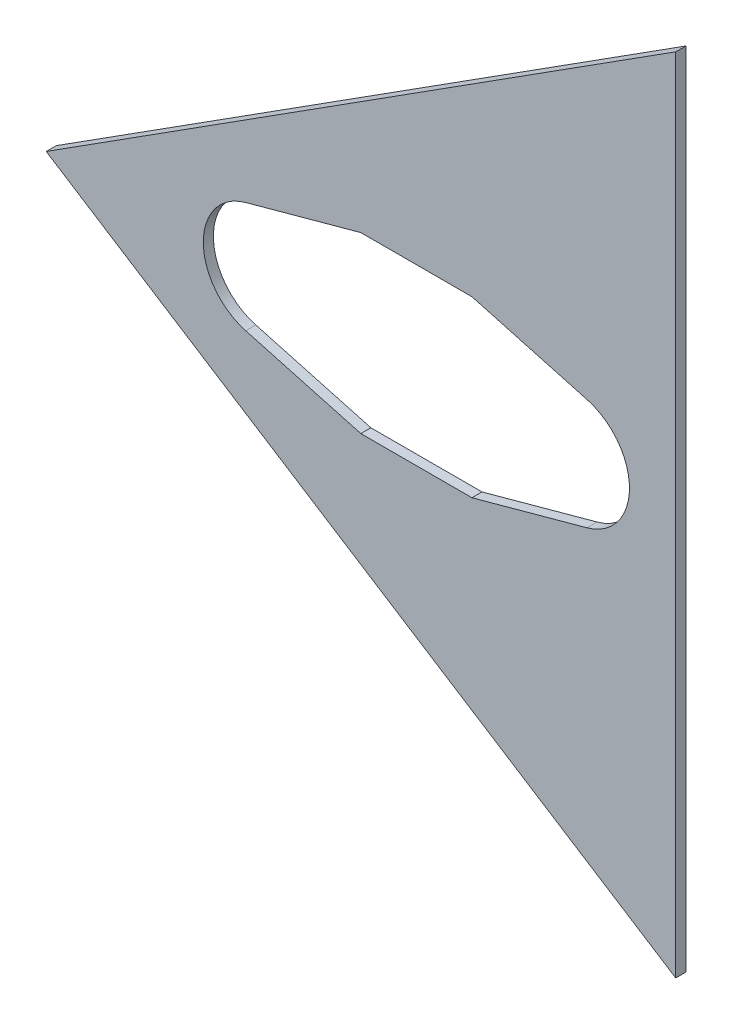
ISO-10303-21;
HEADER;
FILE_DESCRIPTION(('STEP AP214'),'2;1');
FILE_NAME('part.step','',(''),(''),'','','');
FILE_SCHEMA(('AUTOMOTIVE_DESIGN { 1 0 10303 214 1 1 1 1 }'));
ENDSEC;
DATA;
#1=APPLICATION_CONTEXT('core data for automotive mechanical design processes');
#2=APPLICATION_PROTOCOL_DEFINITION('international standard','automotive_design',2000,#1);
#3=PRODUCT_CONTEXT('',#1,'mechanical');
#4=PRODUCT('Part','Part','',(#3));
#5=PRODUCT_RELATED_PRODUCT_CATEGORY('part','',(#4));
#6=PRODUCT_DEFINITION_FORMATION('','',#4);
#7=PRODUCT_DEFINITION_CONTEXT('part definition',#1,'design');
#8=PRODUCT_DEFINITION('design','',#6,#7);
#9=PRODUCT_DEFINITION_SHAPE('','',#8);
#10=(LENGTH_UNIT() NAMED_UNIT(*) SI_UNIT(.MILLI.,.METRE.));
#11=(NAMED_UNIT(*) PLANE_ANGLE_UNIT() SI_UNIT($,.RADIAN.));
#12=(NAMED_UNIT(*) SI_UNIT($,.STERADIAN.) SOLID_ANGLE_UNIT());
#13=UNCERTAINTY_MEASURE_WITH_UNIT(LENGTH_MEASURE(1.E-05),#10,'distance_accuracy_value','');
#14=(GEOMETRIC_REPRESENTATION_CONTEXT(3) GLOBAL_UNCERTAINTY_ASSIGNED_CONTEXT((#13)) GLOBAL_UNIT_ASSIGNED_CONTEXT((#10,
#11,#12)) REPRESENTATION_CONTEXT('',''));
#15=CARTESIAN_POINT('',(0.,0.,0.));
#16=DIRECTION('',(0.,0.,1.));
#17=DIRECTION('',(1.,0.,0.));
#18=AXIS2_PLACEMENT_3D('',#15,#16,#17);
#19=CARTESIAN_POINT('',(244.956408234988,-271.642238892219,6.35));
#20=DIRECTION('',(-1.,0.,0.));
#21=DIRECTION('',(0.,0.,1.));
#22=AXIS2_PLACEMENT_3D('',#19,#20,#21);
#23=PLANE('',#22);
#24=DIRECTION('',(0.,1.,0.));
#25=VECTOR('',#24,1.);
#26=CARTESIAN_POINT('',(244.956408234988,-271.642238892219,0.));
#27=LINE('',#26,#25);
#28=CARTESIAN_POINT('',(244.956408234988,-253.143950627793,0.));
#29=VERTEX_POINT('',#28);
#30=CARTESIAN_POINT('',(244.956408234988,253.143950627793,0.));
#31=VERTEX_POINT('',#30);
#32=EDGE_CURVE('E37',#29,#31,#27,.T.);
#33=ORIENTED_EDGE('',*,*,#32,.T.);
#34=DIRECTION('',(0.,0.,-1.));
#35=VECTOR('',#34,1.);
#36=CARTESIAN_POINT('',(244.956408234988,253.143950627793,6.35));
#37=LINE('',#36,#35);
#38=CARTESIAN_POINT('',(244.956408234988,253.143950627793,6.35));
#39=VERTEX_POINT('',#38);
#40=EDGE_CURVE('E117',#39,#31,#37,.T.);
#41=ORIENTED_EDGE('',*,*,#40,.F.);
#42=DIRECTION('',(0.,1.,0.));
#43=VECTOR('',#42,1.);
#44=CARTESIAN_POINT('',(244.956408234988,-271.642238892219,6.35));
#45=LINE('',#44,#43);
#46=CARTESIAN_POINT('',(244.956408234988,-253.143950627793,6.35));
#47=VERTEX_POINT('',#46);
#48=EDGE_CURVE('E12',#47,#39,#45,.T.);
#49=ORIENTED_EDGE('',*,*,#48,.F.);
#50=DIRECTION('',(0.,0.,-1.));
#51=VECTOR('',#50,1.);
#52=CARTESIAN_POINT('',(244.956408234988,-253.143950627793,6.35));
#53=LINE('',#52,#51);
#54=EDGE_CURVE('E134',#47,#29,#53,.T.);
#55=ORIENTED_EDGE('',*,*,#54,.T.);
#56=EDGE_LOOP('',(#33,#41,#49,#55));
#57=FACE_BOUND('',#56,.T.);
#58=ADVANCED_FACE('F34',(#57),#23,.F.);
#59=CARTESIAN_POINT('',(0.,0.,6.35));
#60=DIRECTION('',(0.,0.,-1.));
#61=DIRECTION('',(-1.,0.,0.));
#62=AXIS2_PLACEMENT_3D('',#59,#60,#61);
#63=PLANE('',#62);
#64=DIRECTION('',(-0.964531430373564,-0.263968028029014,0.));
#65=VECTOR('',#64,1.);
#66=CARTESIAN_POINT('',(189.012254959205,-35.0337106093372,6.35));
#67=LINE('',#66,#65);
#68=CARTESIAN_POINT('',(189.012254959177,-35.0337106092359,6.35));
#69=VERTEX_POINT('',#68);
#70=CARTESIAN_POINT('',(116.321160010383,-54.9274376405847,6.35));
#71=VERTEX_POINT('',#70);
#72=EDGE_CURVE('E161',#69,#71,#67,.T.);
#73=ORIENTED_EDGE('',*,*,#72,.T.);
#74=DIRECTION('',(-1.,-6.80891203858222E-11,0.));
#75=VECTOR('',#74,1.);
#76=CARTESIAN_POINT('',(116.321160010383,-54.9274376405847,6.35));
#77=LINE('',#76,#75);
#78=CARTESIAN_POINT('',(46.1856564408624,-54.9274376453601,6.35));
#79=VERTEX_POINT('',#78);
#80=EDGE_CURVE('E141',#71,#79,#77,.T.);
#81=ORIENTED_EDGE('',*,*,#80,.T.);
#82=DIRECTION('',(-0.964531430335416,0.263968028168406,0.));
#83=VECTOR('',#82,1.);
#84=CARTESIAN_POINT('',(46.1856564408624,-54.9274376453601,6.35));
#85=LINE('',#84,#83);
#86=CARTESIAN_POINT('',(-26.5054384812274,-35.0337106101366,6.35));
#87=VERTEX_POINT('',#86);
#88=EDGE_CURVE('E144',#79,#87,#85,.T.);
#89=ORIENTED_EDGE('',*,*,#88,.T.);
#90=CARTESIAN_POINT('',(-16.9175917579771,0.,6.35));
#91=DIRECTION('',(0.,0.,-1.));
#92=DIRECTION('',(-1.,0.,0.));
#93=AXIS2_PLACEMENT_3D('',#90,#91,#92);
#94=CIRCLE('',#93,36.3219999986693);
#95=CARTESIAN_POINT('',(-26.5054384809467,35.0337106102133,6.35));
#96=VERTEX_POINT('',#95);
#97=EDGE_CURVE('E56',#87,#96,#94,.T.);
#98=ORIENTED_EDGE('',*,*,#97,.T.);
#99=DIRECTION('',(0.964531430365373,0.263968028058944,0.));
#100=VECTOR('',#99,1.);
#101=CARTESIAN_POINT('',(-26.5054384809467,35.0337106102133,6.35));
#102=LINE('',#101,#100);
#103=CARTESIAN_POINT('',(46.1856564448315,54.9274376375788,6.35));
#104=VERTEX_POINT('',#103);
#105=EDGE_CURVE('E149',#96,#104,#102,.T.);
#106=ORIENTED_EDGE('',*,*,#105,.T.);
#107=DIRECTION('',(1.,7.97516418198809E-11,0.));
#108=VECTOR('',#107,1.);
#109=CARTESIAN_POINT('',(46.1856564448315,54.9274376375788,6.35));
#110=LINE('',#109,#108);
#111=CARTESIAN_POINT('',(116.321160010898,54.9274376431723,6.35));
#112=VERTEX_POINT('',#111);
#113=EDGE_CURVE('E152',#104,#112,#110,.T.);
#114=ORIENTED_EDGE('',*,*,#113,.T.);
#115=DIRECTION('',(0.964531430363611,-0.263968028065384,0.));
#116=VECTOR('',#115,1.);
#117=CARTESIAN_POINT('',(116.321160010898,54.9274376431723,6.35));
#118=LINE('',#117,#116);
#119=CARTESIAN_POINT('',(189.012254957019,35.0337106097177,6.35));
#120=VERTEX_POINT('',#119);
#121=EDGE_CURVE('E155',#112,#120,#118,.T.);
#122=ORIENTED_EDGE('',*,*,#121,.T.);
#123=CARTESIAN_POINT('',(179.424408237212,0.,6.35));
#124=DIRECTION('',(0.,0.,-1.));
#125=DIRECTION('',(-1.,0.,0.));
#126=AXIS2_PLACEMENT_3D('',#123,#124,#125);
#127=CIRCLE('',#126,36.3219999974614);
#128=EDGE_CURVE('E158',#120,#69,#127,.T.);
#129=ORIENTED_EDGE('',*,*,#128,.T.);
#130=EDGE_LOOP('',(#73,#81,#89,#98,#106,#114,#122,#129));
#131=FACE_BOUND('',#130,.T.);
#132=ORIENTED_EDGE('',*,*,#48,.T.);
#133=DIRECTION('',(-0.843391445812885,-0.537299608346825,0.));
#134=VECTOR('',#133,1.);
#135=CARTESIAN_POINT('',(244.956408234988,253.143950627793,6.35));
#136=LINE('',#135,#134);
#137=CARTESIAN_POINT('',(-152.4,0.,6.35));
#138=VERTEX_POINT('',#137);
#139=EDGE_CURVE('E114',#39,#138,#136,.T.);
#140=ORIENTED_EDGE('',*,*,#139,.T.);
#141=DIRECTION('',(0.843391445812885,-0.537299608346825,0.));
#142=VECTOR('',#141,1.);
#143=CARTESIAN_POINT('',(244.956408234988,-253.143950627793,6.35));
#144=LINE('',#143,#142);
#145=EDGE_CURVE('E122',#138,#47,#144,.T.);
#146=ORIENTED_EDGE('',*,*,#145,.T.);
#147=EDGE_LOOP('',(#132,#140,#146));
#148=FACE_BOUND('',#147,.T.);
#149=ADVANCED_FACE('F132',(#131,#148),#63,.F.);
#150=CARTESIAN_POINT('',(0.,0.,0.));
#151=DIRECTION('',(0.,0.,-1.));
#152=DIRECTION('',(-1.,0.,0.));
#153=AXIS2_PLACEMENT_3D('',#150,#151,#152);
#154=PLANE('',#153);
#155=DIRECTION('',(-0.843391445812885,-0.537299608346825,0.));
#156=VECTOR('',#155,1.);
#157=CARTESIAN_POINT('',(244.956408234988,253.143950627793,0.));
#158=LINE('',#157,#156);
#159=CARTESIAN_POINT('',(-152.4,0.,0.));
#160=VERTEX_POINT('',#159);
#161=EDGE_CURVE('E48',#31,#160,#158,.T.);
#162=ORIENTED_EDGE('',*,*,#161,.F.);
#163=ORIENTED_EDGE('',*,*,#32,.F.);
#164=DIRECTION('',(0.843391445812885,-0.537299608346825,0.));
#165=VECTOR('',#164,1.);
#166=CARTESIAN_POINT('',(244.956408234988,-253.143950627793,0.));
#167=LINE('',#166,#165);
#168=EDGE_CURVE('E123',#160,#29,#167,.T.);
#169=ORIENTED_EDGE('',*,*,#168,.F.);
#170=EDGE_LOOP('',(#162,#163,#169));
#171=FACE_BOUND('',#170,.T.);
#172=DIRECTION('',(-1.,-6.80891203858222E-11,0.));
#173=VECTOR('',#172,1.);
#174=CARTESIAN_POINT('',(116.321160010383,-54.9274376405847,0.));
#175=LINE('',#174,#173);
#176=CARTESIAN_POINT('',(116.321160010383,-54.9274376405847,0.));
#177=VERTEX_POINT('',#176);
#178=CARTESIAN_POINT('',(46.1856564408624,-54.9274376453601,0.));
#179=VERTEX_POINT('',#178);
#180=EDGE_CURVE('E130',#177,#179,#175,.T.);
#181=ORIENTED_EDGE('',*,*,#180,.F.);
#182=DIRECTION('',(-0.964531430373564,-0.263968028029014,0.));
#183=VECTOR('',#182,1.);
#184=CARTESIAN_POINT('',(189.012254959205,-35.0337106093372,0.));
#185=LINE('',#184,#183);
#186=CARTESIAN_POINT('',(189.012254959177,-35.0337106092359,0.));
#187=VERTEX_POINT('',#186);
#188=EDGE_CURVE('E145',#187,#177,#185,.T.);
#189=ORIENTED_EDGE('',*,*,#188,.F.);
#190=CARTESIAN_POINT('',(179.424408237212,0.,0.));
#191=DIRECTION('',(0.,0.,-1.));
#192=DIRECTION('',(-1.,0.,0.));
#193=AXIS2_PLACEMENT_3D('',#190,#191,#192);
#194=CIRCLE('',#193,36.3219999974614);
#195=CARTESIAN_POINT('',(189.012254957019,35.0337106097177,0.));
#196=VERTEX_POINT('',#195);
#197=EDGE_CURVE('E181',#196,#187,#194,.T.);
#198=ORIENTED_EDGE('',*,*,#197,.F.);
#199=DIRECTION('',(0.964531430363611,-0.263968028065384,0.));
#200=VECTOR('',#199,1.);
#201=CARTESIAN_POINT('',(116.321160010898,54.9274376431723,0.));
#202=LINE('',#201,#200);
#203=CARTESIAN_POINT('',(116.321160010898,54.9274376431723,0.));
#204=VERTEX_POINT('',#203);
#205=EDGE_CURVE('E178',#204,#196,#202,.T.);
#206=ORIENTED_EDGE('',*,*,#205,.F.);
#207=DIRECTION('',(1.,7.97516418198809E-11,0.));
#208=VECTOR('',#207,1.);
#209=CARTESIAN_POINT('',(46.1856564448315,54.9274376375788,0.));
#210=LINE('',#209,#208);
#211=CARTESIAN_POINT('',(46.1856564448315,54.9274376375788,0.));
#212=VERTEX_POINT('',#211);
#213=EDGE_CURVE('E175',#212,#204,#210,.T.);
#214=ORIENTED_EDGE('',*,*,#213,.F.);
#215=DIRECTION('',(0.964531430365373,0.263968028058944,0.));
#216=VECTOR('',#215,1.);
#217=CARTESIAN_POINT('',(-26.5054384809467,35.0337106102133,0.));
#218=LINE('',#217,#216);
#219=CARTESIAN_POINT('',(-26.5054384809467,35.0337106102133,0.));
#220=VERTEX_POINT('',#219);
#221=EDGE_CURVE('E172',#220,#212,#218,.T.);
#222=ORIENTED_EDGE('',*,*,#221,.F.);
#223=CARTESIAN_POINT('',(-16.9175917579771,0.,0.));
#224=DIRECTION('',(0.,0.,-1.));
#225=DIRECTION('',(-1.,0.,0.));
#226=AXIS2_PLACEMENT_3D('',#223,#224,#225);
#227=CIRCLE('',#226,36.3219999986693);
#228=CARTESIAN_POINT('',(-26.5054384812274,-35.0337106101366,0.));
#229=VERTEX_POINT('',#228);
#230=EDGE_CURVE('E169',#229,#220,#227,.T.);
#231=ORIENTED_EDGE('',*,*,#230,.F.);
#232=DIRECTION('',(-0.964531430335416,0.263968028168406,0.));
#233=VECTOR('',#232,1.);
#234=CARTESIAN_POINT('',(46.1856564408624,-54.9274376453601,0.));
#235=LINE('',#234,#233);
#236=EDGE_CURVE('E166',#179,#229,#235,.T.);
#237=ORIENTED_EDGE('',*,*,#236,.F.);
#238=EDGE_LOOP('',(#181,#189,#198,#206,#214,#222,#231,#237));
#239=FACE_BOUND('',#238,.T.);
#240=ADVANCED_FACE('F210',(#171,#239),#154,.T.);
#241=CARTESIAN_POINT('',(116.321160010383,-54.9274376405847,6.35));
#242=DIRECTION('',(6.80891203858222E-11,-1.,0.));
#243=DIRECTION('',(1.,6.80891203858222E-11,0.));
#244=AXIS2_PLACEMENT_3D('',#241,#242,#243);
#245=PLANE('',#244);
#246=ORIENTED_EDGE('',*,*,#180,.T.);
#247=DIRECTION('',(0.,0.,-1.));
#248=VECTOR('',#247,1.);
#249=CARTESIAN_POINT('',(46.1856564408624,-54.9274376453601,6.35));
#250=LINE('',#249,#248);
#251=EDGE_CURVE('E164',#79,#179,#250,.T.);
#252=ORIENTED_EDGE('',*,*,#251,.F.);
#253=ORIENTED_EDGE('',*,*,#80,.F.);
#254=DIRECTION('',(0.,0.,-1.));
#255=VECTOR('',#254,1.);
#256=CARTESIAN_POINT('',(116.321160010383,-54.9274376405847,6.35));
#257=LINE('',#256,#255);
#258=EDGE_CURVE('E186',#71,#177,#257,.T.);
#259=ORIENTED_EDGE('',*,*,#258,.T.);
#260=EDGE_LOOP('',(#246,#252,#253,#259));
#261=FACE_BOUND('',#260,.T.);
#262=ADVANCED_FACE('F218',(#261),#245,.F.);
#263=CARTESIAN_POINT('',(189.012254959205,-35.0337106093372,6.35));
#264=DIRECTION('',(0.263968028029013,-0.964531430373564,0.));
#265=DIRECTION('',(0.964531430373564,0.263968028029013,0.));
#266=AXIS2_PLACEMENT_3D('',#263,#264,#265);
#267=PLANE('',#266);
#268=ORIENTED_EDGE('',*,*,#188,.T.);
#269=ORIENTED_EDGE('',*,*,#258,.F.);
#270=ORIENTED_EDGE('',*,*,#72,.F.);
#271=DIRECTION('',(0.,0.,-1.));
#272=VECTOR('',#271,1.);
#273=CARTESIAN_POINT('',(189.012254959177,-35.0337106092359,6.35));
#274=LINE('',#273,#272);
#275=EDGE_CURVE('E188',#69,#187,#274,.T.);
#276=ORIENTED_EDGE('',*,*,#275,.T.);
#277=EDGE_LOOP('',(#268,#269,#270,#276));
#278=FACE_BOUND('',#277,.T.);
#279=ADVANCED_FACE('F220',(#278),#267,.F.);
#280=CARTESIAN_POINT('',(179.424408237212,0.,6.35));
#281=DIRECTION('',(0.,0.,-1.));
#282=DIRECTION('',(-1.,0.,0.));
#283=AXIS2_PLACEMENT_3D('',#280,#281,#282);
#284=CYLINDRICAL_SURFACE('',#283,36.3219999974614);
#285=ORIENTED_EDGE('',*,*,#197,.T.);
#286=ORIENTED_EDGE('',*,*,#275,.F.);
#287=ORIENTED_EDGE('',*,*,#128,.F.);
#288=DIRECTION('',(0.,0.,-1.));
#289=VECTOR('',#288,1.);
#290=CARTESIAN_POINT('',(189.012254957019,35.0337106097177,6.35));
#291=LINE('',#290,#289);
#292=EDGE_CURVE('E190',#120,#196,#291,.T.);
#293=ORIENTED_EDGE('',*,*,#292,.T.);
#294=EDGE_LOOP('',(#285,#286,#287,#293));
#295=FACE_BOUND('',#294,.T.);
#296=ADVANCED_FACE('F224',(#295),#284,.F.);
#297=CARTESIAN_POINT('',(116.321160010898,54.9274376431723,6.35));
#298=DIRECTION('',(0.263968028065384,0.96453143036361,0.));
#299=DIRECTION('',(-0.964531430363611,0.263968028065384,0.));
#300=AXIS2_PLACEMENT_3D('',#297,#298,#299);
#301=PLANE('',#300);
#302=ORIENTED_EDGE('',*,*,#205,.T.);
#303=ORIENTED_EDGE('',*,*,#292,.F.);
#304=ORIENTED_EDGE('',*,*,#121,.F.);
#305=DIRECTION('',(0.,0.,-1.));
#306=VECTOR('',#305,1.);
#307=CARTESIAN_POINT('',(116.321160010898,54.9274376431723,6.35));
#308=LINE('',#307,#306);
#309=EDGE_CURVE('E192',#112,#204,#308,.T.);
#310=ORIENTED_EDGE('',*,*,#309,.T.);
#311=EDGE_LOOP('',(#302,#303,#304,#310));
#312=FACE_BOUND('',#311,.T.);
#313=ADVANCED_FACE('F228',(#312),#301,.F.);
#314=CARTESIAN_POINT('',(46.1856564448315,54.9274376375788,6.35));
#315=DIRECTION('',(-7.97516418198809E-11,1.,0.));
#316=DIRECTION('',(-1.,-7.97516418198809E-11,0.));
#317=AXIS2_PLACEMENT_3D('',#314,#315,#316);
#318=PLANE('',#317);
#319=ORIENTED_EDGE('',*,*,#213,.T.);
#320=ORIENTED_EDGE('',*,*,#309,.F.);
#321=ORIENTED_EDGE('',*,*,#113,.F.);
#322=DIRECTION('',(0.,0.,-1.));
#323=VECTOR('',#322,1.);
#324=CARTESIAN_POINT('',(46.1856564448315,54.9274376375788,6.35));
#325=LINE('',#324,#323);
#326=EDGE_CURVE('E194',#104,#212,#325,.T.);
#327=ORIENTED_EDGE('',*,*,#326,.T.);
#328=EDGE_LOOP('',(#319,#320,#321,#327));
#329=FACE_BOUND('',#328,.T.);
#330=ADVANCED_FACE('F231',(#329),#318,.F.);
#331=CARTESIAN_POINT('',(-26.5054384809467,35.0337106102133,6.35));
#332=DIRECTION('',(-0.263968028058944,0.964531430365373,0.));
#333=DIRECTION('',(-0.964531430365373,-0.263968028058944,0.));
#334=AXIS2_PLACEMENT_3D('',#331,#332,#333);
#335=PLANE('',#334);
#336=ORIENTED_EDGE('',*,*,#221,.T.);
#337=ORIENTED_EDGE('',*,*,#326,.F.);
#338=ORIENTED_EDGE('',*,*,#105,.F.);
#339=DIRECTION('',(0.,0.,-1.));
#340=VECTOR('',#339,1.);
#341=CARTESIAN_POINT('',(-26.5054384809467,35.0337106102133,6.35));
#342=LINE('',#341,#340);
#343=EDGE_CURVE('E196',#96,#220,#342,.T.);
#344=ORIENTED_EDGE('',*,*,#343,.T.);
#345=EDGE_LOOP('',(#336,#337,#338,#344));
#346=FACE_BOUND('',#345,.T.);
#347=ADVANCED_FACE('F233',(#346),#335,.F.);
#348=CARTESIAN_POINT('',(-16.9175917579771,0.,6.35));
#349=DIRECTION('',(0.,0.,-1.));
#350=DIRECTION('',(-1.,0.,0.));
#351=AXIS2_PLACEMENT_3D('',#348,#349,#350);
#352=CYLINDRICAL_SURFACE('',#351,36.3219999986693);
#353=ORIENTED_EDGE('',*,*,#230,.T.);
#354=ORIENTED_EDGE('',*,*,#343,.F.);
#355=ORIENTED_EDGE('',*,*,#97,.F.);
#356=DIRECTION('',(0.,0.,-1.));
#357=VECTOR('',#356,1.);
#358=CARTESIAN_POINT('',(-26.5054384812274,-35.0337106101366,6.35));
#359=LINE('',#358,#357);
#360=EDGE_CURVE('E198',#87,#229,#359,.T.);
#361=ORIENTED_EDGE('',*,*,#360,.T.);
#362=EDGE_LOOP('',(#353,#354,#355,#361));
#363=FACE_BOUND('',#362,.T.);
#364=ADVANCED_FACE('F214',(#363),#352,.F.);
#365=CARTESIAN_POINT('',(46.1856564408624,-54.9274376453601,6.35));
#366=DIRECTION('',(-0.263968028168406,-0.964531430335416,0.));
#367=DIRECTION('',(0.964531430335416,-0.263968028168407,0.));
#368=AXIS2_PLACEMENT_3D('',#365,#366,#367);
#369=PLANE('',#368);
#370=ORIENTED_EDGE('',*,*,#236,.T.);
#371=ORIENTED_EDGE('',*,*,#360,.F.);
#372=ORIENTED_EDGE('',*,*,#88,.F.);
#373=ORIENTED_EDGE('',*,*,#251,.T.);
#374=EDGE_LOOP('',(#370,#371,#372,#373));
#375=FACE_BOUND('',#374,.T.);
#376=ADVANCED_FACE('F204',(#375),#369,.F.);
#377=CARTESIAN_POINT('',(244.956408234988,253.143950627793,6.35));
#378=DIRECTION('',(0.537299608346825,-0.843391445812885,0.));
#379=DIRECTION('',(0.843391445812885,0.537299608346825,0.));
#380=AXIS2_PLACEMENT_3D('',#377,#378,#379);
#381=PLANE('',#380);
#382=ORIENTED_EDGE('',*,*,#161,.T.);
#383=DIRECTION('',(0.,0.,-1.));
#384=VECTOR('',#383,1.);
#385=CARTESIAN_POINT('',(-152.4,0.,6.35));
#386=LINE('',#385,#384);
#387=EDGE_CURVE('E118',#138,#160,#386,.T.);
#388=ORIENTED_EDGE('',*,*,#387,.F.);
#389=ORIENTED_EDGE('',*,*,#139,.F.);
#390=ORIENTED_EDGE('',*,*,#40,.T.);
#391=EDGE_LOOP('',(#382,#388,#389,#390));
#392=FACE_BOUND('',#391,.T.);
#393=ADVANCED_FACE('F116',(#392),#381,.F.);
#394=CARTESIAN_POINT('',(244.956408234988,-253.143950627793,6.35));
#395=DIRECTION('',(0.537299608346825,0.843391445812885,0.));
#396=DIRECTION('',(-0.843391445812885,0.537299608346825,0.));
#397=AXIS2_PLACEMENT_3D('',#394,#395,#396);
#398=PLANE('',#397);
#399=ORIENTED_EDGE('',*,*,#168,.T.);
#400=ORIENTED_EDGE('',*,*,#54,.F.);
#401=ORIENTED_EDGE('',*,*,#145,.F.);
#402=ORIENTED_EDGE('',*,*,#387,.T.);
#403=EDGE_LOOP('',(#399,#400,#401,#402));
#404=FACE_BOUND('',#403,.T.);
#405=ADVANCED_FACE('F258',(#404),#398,.F.);
#406=CLOSED_SHELL('',(#58,#149,#240,#262,#279,#296,#313,#330,#347,#364,#376,#393,#405));
#407=MANIFOLD_SOLID_BREP('B2',#406);
#408=ADVANCED_BREP_SHAPE_REPRESENTATION('',(#18,#407),#14);
#409=SHAPE_DEFINITION_REPRESENTATION(#9,#408);
ENDSEC;
END-ISO-10303-21;
